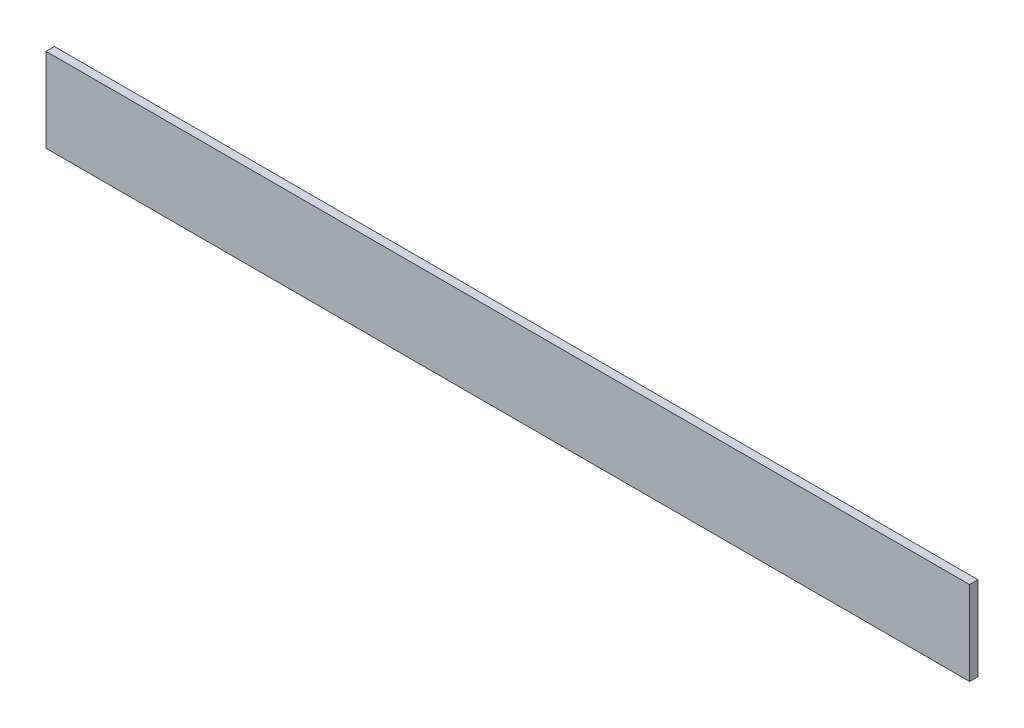
ISO-10303-21;
HEADER;
FILE_DESCRIPTION(('STEP AP214'),'2;1');
FILE_NAME('part.step','',(''),(''),'','','');
FILE_SCHEMA(('AUTOMOTIVE_DESIGN { 1 0 10303 214 1 1 1 1 }'));
ENDSEC;
DATA;
#1=APPLICATION_CONTEXT('core data for automotive mechanical design processes');
#2=APPLICATION_PROTOCOL_DEFINITION('international standard','automotive_design',2000,#1);
#3=PRODUCT_CONTEXT('',#1,'mechanical');
#4=PRODUCT('Part','Part','',(#3));
#5=PRODUCT_RELATED_PRODUCT_CATEGORY('part','',(#4));
#6=PRODUCT_DEFINITION_FORMATION('','',#4);
#7=PRODUCT_DEFINITION_CONTEXT('part definition',#1,'design');
#8=PRODUCT_DEFINITION('design','',#6,#7);
#9=PRODUCT_DEFINITION_SHAPE('','',#8);
#10=(LENGTH_UNIT() NAMED_UNIT(*) SI_UNIT(.MILLI.,.METRE.));
#11=(NAMED_UNIT(*) PLANE_ANGLE_UNIT() SI_UNIT($,.RADIAN.));
#12=(NAMED_UNIT(*) SI_UNIT($,.STERADIAN.) SOLID_ANGLE_UNIT());
#13=UNCERTAINTY_MEASURE_WITH_UNIT(LENGTH_MEASURE(1.E-05),#10,'distance_accuracy_value','');
#14=(GEOMETRIC_REPRESENTATION_CONTEXT(3) GLOBAL_UNCERTAINTY_ASSIGNED_CONTEXT((#13)) GLOBAL_UNIT_ASSIGNED_CONTEXT((#10,
#11,#12)) REPRESENTATION_CONTEXT('',''));
#15=CARTESIAN_POINT('',(0.,0.,0.));
#16=DIRECTION('',(0.,0.,1.));
#17=DIRECTION('',(1.,0.,0.));
#18=AXIS2_PLACEMENT_3D('',#15,#16,#17);
#19=CARTESIAN_POINT('',(275.,25.,5.));
#20=DIRECTION('',(-1.,0.,0.));
#21=DIRECTION('',(0.,0.,1.));
#22=AXIS2_PLACEMENT_3D('',#19,#20,#21);
#23=PLANE('',#22);
#24=DIRECTION('',(0.,1.,0.));
#25=VECTOR('',#24,1.);
#26=CARTESIAN_POINT('',(275.,25.,0.));
#27=LINE('',#26,#25);
#28=CARTESIAN_POINT('',(275.,-25.,0.));
#29=VERTEX_POINT('',#28);
#30=CARTESIAN_POINT('',(275.,25.,0.));
#31=VERTEX_POINT('',#30);
#32=EDGE_CURVE('E96',#29,#31,#27,.T.);
#33=ORIENTED_EDGE('',*,*,#32,.T.);
#34=DIRECTION('',(0.,0.,-1.));
#35=VECTOR('',#34,1.);
#36=CARTESIAN_POINT('',(275.,25.,5.));
#37=LINE('',#36,#35);
#38=CARTESIAN_POINT('',(275.,25.,5.));
#39=VERTEX_POINT('',#38);
#40=EDGE_CURVE('E11',#39,#31,#37,.T.);
#41=ORIENTED_EDGE('',*,*,#40,.F.);
#42=DIRECTION('',(0.,1.,0.));
#43=VECTOR('',#42,1.);
#44=CARTESIAN_POINT('',(275.,25.,5.));
#45=LINE('',#44,#43);
#46=CARTESIAN_POINT('',(275.,-25.,5.));
#47=VERTEX_POINT('',#46);
#48=EDGE_CURVE('E84',#47,#39,#45,.T.);
#49=ORIENTED_EDGE('',*,*,#48,.F.);
#50=DIRECTION('',(0.,0.,-1.));
#51=VECTOR('',#50,1.);
#52=CARTESIAN_POINT('',(275.,-25.,5.));
#53=LINE('',#52,#51);
#54=EDGE_CURVE('E92',#47,#29,#53,.T.);
#55=ORIENTED_EDGE('',*,*,#54,.T.);
#56=EDGE_LOOP('',(#33,#41,#49,#55));
#57=FACE_BOUND('',#56,.T.);
#58=ADVANCED_FACE('F33',(#57),#23,.F.);
#59=CARTESIAN_POINT('',(-275.,25.,5.));
#60=DIRECTION('',(0.,-1.,0.));
#61=DIRECTION('',(0.,0.,-1.));
#62=AXIS2_PLACEMENT_3D('',#59,#60,#61);
#63=PLANE('',#62);
#64=DIRECTION('',(-1.,0.,0.));
#65=VECTOR('',#64,1.);
#66=CARTESIAN_POINT('',(-275.,25.,0.));
#67=LINE('',#66,#65);
#68=CARTESIAN_POINT('',(-275.,25.,0.));
#69=VERTEX_POINT('',#68);
#70=EDGE_CURVE('E88',#31,#69,#67,.T.);
#71=ORIENTED_EDGE('',*,*,#70,.T.);
#72=DIRECTION('',(0.,0.,-1.));
#73=VECTOR('',#72,1.);
#74=CARTESIAN_POINT('',(-275.,25.,5.));
#75=LINE('',#74,#73);
#76=CARTESIAN_POINT('',(-275.,25.,5.));
#77=VERTEX_POINT('',#76);
#78=EDGE_CURVE('E41',#77,#69,#75,.T.);
#79=ORIENTED_EDGE('',*,*,#78,.F.);
#80=DIRECTION('',(-1.,0.,0.));
#81=VECTOR('',#80,1.);
#82=CARTESIAN_POINT('',(-275.,25.,5.));
#83=LINE('',#82,#81);
#84=EDGE_CURVE('E79',#39,#77,#83,.T.);
#85=ORIENTED_EDGE('',*,*,#84,.F.);
#86=ORIENTED_EDGE('',*,*,#40,.T.);
#87=EDGE_LOOP('',(#71,#79,#85,#86));
#88=FACE_BOUND('',#87,.T.);
#89=ADVANCED_FACE('F87',(#88),#63,.F.);
#90=CARTESIAN_POINT('',(-275.,25.,5.));
#91=DIRECTION('',(1.,0.,0.));
#92=DIRECTION('',(0.,0.,-1.));
#93=AXIS2_PLACEMENT_3D('',#90,#91,#92);
#94=PLANE('',#93);
#95=DIRECTION('',(0.,-1.,0.));
#96=VECTOR('',#95,1.);
#97=CARTESIAN_POINT('',(-275.,25.,0.));
#98=LINE('',#97,#96);
#99=CARTESIAN_POINT('',(-275.,-25.,0.));
#100=VERTEX_POINT('',#99);
#101=EDGE_CURVE('E66',#69,#100,#98,.T.);
#102=ORIENTED_EDGE('',*,*,#101,.T.);
#103=DIRECTION('',(0.,0.,-1.));
#104=VECTOR('',#103,1.);
#105=CARTESIAN_POINT('',(-275.,-25.,5.));
#106=LINE('',#105,#104);
#107=CARTESIAN_POINT('',(-275.,-25.,5.));
#108=VERTEX_POINT('',#107);
#109=EDGE_CURVE('E89',#108,#100,#106,.T.);
#110=ORIENTED_EDGE('',*,*,#109,.F.);
#111=DIRECTION('',(0.,-1.,0.));
#112=VECTOR('',#111,1.);
#113=CARTESIAN_POINT('',(-275.,25.,5.));
#114=LINE('',#113,#112);
#115=EDGE_CURVE('E82',#77,#108,#114,.T.);
#116=ORIENTED_EDGE('',*,*,#115,.F.);
#117=ORIENTED_EDGE('',*,*,#78,.T.);
#118=EDGE_LOOP('',(#102,#110,#116,#117));
#119=FACE_BOUND('',#118,.T.);
#120=ADVANCED_FACE('F90',(#119),#94,.F.);
#121=CARTESIAN_POINT('',(-275.,-25.,5.));
#122=DIRECTION('',(0.,1.,0.));
#123=DIRECTION('',(0.,0.,1.));
#124=AXIS2_PLACEMENT_3D('',#121,#122,#123);
#125=PLANE('',#124);
#126=DIRECTION('',(1.,0.,0.));
#127=VECTOR('',#126,1.);
#128=CARTESIAN_POINT('',(-275.,-25.,0.));
#129=LINE('',#128,#127);
#130=EDGE_CURVE('E72',#100,#29,#129,.T.);
#131=ORIENTED_EDGE('',*,*,#130,.T.);
#132=ORIENTED_EDGE('',*,*,#54,.F.);
#133=DIRECTION('',(1.,0.,0.));
#134=VECTOR('',#133,1.);
#135=CARTESIAN_POINT('',(-275.,-25.,5.));
#136=LINE('',#135,#134);
#137=EDGE_CURVE('E49',#108,#47,#136,.T.);
#138=ORIENTED_EDGE('',*,*,#137,.F.);
#139=ORIENTED_EDGE('',*,*,#109,.T.);
#140=EDGE_LOOP('',(#131,#132,#138,#139));
#141=FACE_BOUND('',#140,.T.);
#142=ADVANCED_FACE('F103',(#141),#125,.F.);
#143=CARTESIAN_POINT('',(0.,0.,5.));
#144=DIRECTION('',(0.,0.,1.));
#145=DIRECTION('',(1.,0.,0.));
#146=AXIS2_PLACEMENT_3D('',#143,#144,#145);
#147=PLANE('',#146);
#148=ORIENTED_EDGE('',*,*,#48,.T.);
#149=ORIENTED_EDGE('',*,*,#84,.T.);
#150=ORIENTED_EDGE('',*,*,#115,.T.);
#151=ORIENTED_EDGE('',*,*,#137,.T.);
#152=EDGE_LOOP('',(#148,#149,#150,#151));
#153=FACE_BOUND('',#152,.T.);
#154=ADVANCED_FACE('F80',(#153),#147,.T.);
#155=CARTESIAN_POINT('',(0.,0.,0.));
#156=DIRECTION('',(0.,0.,1.));
#157=DIRECTION('',(1.,0.,0.));
#158=AXIS2_PLACEMENT_3D('',#155,#156,#157);
#159=PLANE('',#158);
#160=ORIENTED_EDGE('',*,*,#32,.F.);
#161=ORIENTED_EDGE('',*,*,#130,.F.);
#162=ORIENTED_EDGE('',*,*,#101,.F.);
#163=ORIENTED_EDGE('',*,*,#70,.F.);
#164=EDGE_LOOP('',(#160,#161,#162,#163));
#165=FACE_BOUND('',#164,.T.);
#166=ADVANCED_FACE('F106',(#165),#159,.F.);
#167=CLOSED_SHELL('',(#58,#89,#120,#142,#154,#166));
#168=MANIFOLD_SOLID_BREP('B2',#167);
#169=ADVANCED_BREP_SHAPE_REPRESENTATION('',(#18,#168),#14);
#170=SHAPE_DEFINITION_REPRESENTATION(#9,#169);
ENDSEC;
END-ISO-10303-21;
